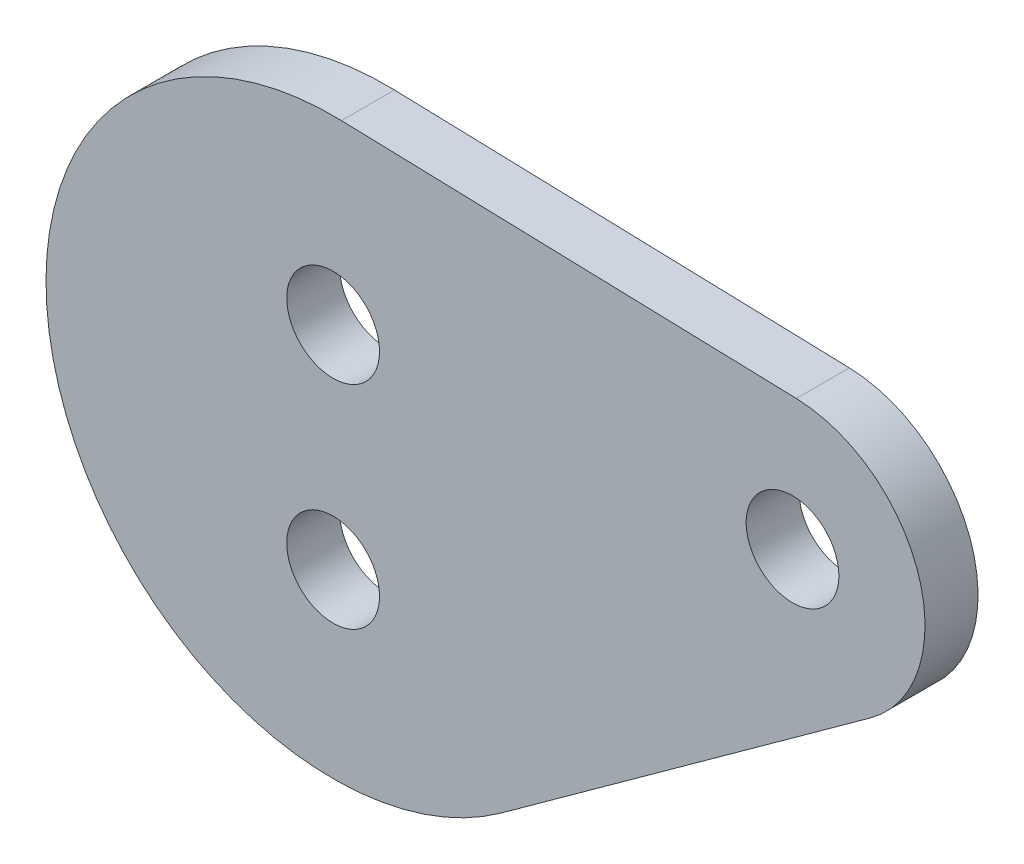
ISO-10303-21;
HEADER;
FILE_DESCRIPTION(('STEP AP214'),'2;1');
FILE_NAME('part.step','',(''),(''),'','','');
FILE_SCHEMA(('AUTOMOTIVE_DESIGN { 1 0 10303 214 1 1 1 1 }'));
ENDSEC;
DATA;
#1=APPLICATION_CONTEXT('core data for automotive mechanical design processes');
#2=APPLICATION_PROTOCOL_DEFINITION('international standard','automotive_design',2000,#1);
#3=PRODUCT_CONTEXT('',#1,'mechanical');
#4=PRODUCT('Part','Part','',(#3));
#5=PRODUCT_RELATED_PRODUCT_CATEGORY('part','',(#4));
#6=PRODUCT_DEFINITION_FORMATION('','',#4);
#7=PRODUCT_DEFINITION_CONTEXT('part definition',#1,'design');
#8=PRODUCT_DEFINITION('design','',#6,#7);
#9=PRODUCT_DEFINITION_SHAPE('','',#8);
#10=(LENGTH_UNIT() NAMED_UNIT(*) SI_UNIT(.MILLI.,.METRE.));
#11=(NAMED_UNIT(*) PLANE_ANGLE_UNIT() SI_UNIT($,.RADIAN.));
#12=(NAMED_UNIT(*) SI_UNIT($,.STERADIAN.) SOLID_ANGLE_UNIT());
#13=UNCERTAINTY_MEASURE_WITH_UNIT(LENGTH_MEASURE(1.E-05),#10,'distance_accuracy_value','');
#14=(GEOMETRIC_REPRESENTATION_CONTEXT(3) GLOBAL_UNCERTAINTY_ASSIGNED_CONTEXT((#13)) GLOBAL_UNIT_ASSIGNED_CONTEXT((#10,
#11,#12)) REPRESENTATION_CONTEXT('',''));
#15=CARTESIAN_POINT('',(0.,0.,0.));
#16=DIRECTION('',(0.,0.,1.));
#17=DIRECTION('',(1.,0.,0.));
#18=AXIS2_PLACEMENT_3D('',#15,#16,#17);
#19=CARTESIAN_POINT('',(0.,0.,6.));
#20=DIRECTION('',(0.,0.,1.));
#21=DIRECTION('',(1.,0.,0.));
#22=AXIS2_PLACEMENT_3D('',#19,#20,#21);
#23=PLANE('',#22);
#24=CARTESIAN_POINT('',(0.,-12.,6.));
#25=DIRECTION('',(0.,0.,1.));
#26=DIRECTION('',(-1.,0.,0.));
#27=AXIS2_PLACEMENT_3D('',#24,#25,#26);
#28=CIRCLE('',#27,5.25);
#29=CARTESIAN_POINT('',(-5.25,-12.,6.));
#30=VERTEX_POINT('',#29);
#31=EDGE_CURVE('E121',#30,#30,#28,.T.);
#32=ORIENTED_EDGE('',*,*,#31,.F.);
#33=EDGE_LOOP('',(#32));
#34=FACE_BOUND('',#33,.T.);
#35=CARTESIAN_POINT('',(0.,0.,6.));
#36=DIRECTION('',(0.,0.,1.));
#37=DIRECTION('',(1.,0.,0.));
#38=AXIS2_PLACEMENT_3D('',#35,#36,#37);
#39=CIRCLE('',#38,32.5);
#40=CARTESIAN_POINT('',(0.941698734756451,32.4863541120415,6.));
#41=VERTEX_POINT('',#40);
#42=CARTESIAN_POINT('',(19.0414093733517,-26.3377054633929,6.));
#43=VERTEX_POINT('',#42);
#44=EDGE_CURVE('E91',#41,#43,#39,.T.);
#45=ORIENTED_EDGE('',*,*,#44,.T.);
#46=DIRECTION('',(0.810390937335166,0.585889519180051,0.));
#47=VECTOR('',#46,1.);
#48=CARTESIAN_POINT('',(60.7883427877008,3.84413593997251,6.));
#49=LINE('',#48,#47);
#50=CARTESIAN_POINT('',(60.7883427877008,3.84413593997251,6.));
#51=VERTEX_POINT('',#50);
#52=EDGE_CURVE('E86',#43,#51,#49,.T.);
#53=ORIENTED_EDGE('',*,*,#52,.T.);
#54=CARTESIAN_POINT('',(52.,16.,6.));
#55=DIRECTION('',(0.,0.,1.));
#56=DIRECTION('',(1.,0.,0.));
#57=AXIS2_PLACEMENT_3D('',#54,#55,#56);
#58=CIRCLE('',#57,15.);
#59=CARTESIAN_POINT('',(52.4346301852722,30.9937018978653,6.));
#60=VERTEX_POINT('',#59);
#61=EDGE_CURVE('E89',#51,#60,#58,.T.);
#62=ORIENTED_EDGE('',*,*,#61,.T.);
#63=DIRECTION('',(-0.999580126524355,0.028975345684814,0.));
#64=VECTOR('',#63,1.);
#65=CARTESIAN_POINT('',(0.941698734756451,32.4863541120415,6.));
#66=LINE('',#65,#64);
#67=EDGE_CURVE('E56',#60,#41,#66,.T.);
#68=ORIENTED_EDGE('',*,*,#67,.T.);
#69=EDGE_LOOP('',(#45,#53,#62,#68));
#70=FACE_BOUND('',#69,.T.);
#71=CARTESIAN_POINT('',(0.,12.,6.));
#72=DIRECTION('',(0.,0.,1.));
#73=DIRECTION('',(1.,0.,0.));
#74=AXIS2_PLACEMENT_3D('',#71,#72,#73);
#75=CIRCLE('',#74,5.25);
#76=CARTESIAN_POINT('',(5.25,12.,6.));
#77=VERTEX_POINT('',#76);
#78=EDGE_CURVE('E106',#77,#77,#75,.T.);
#79=ORIENTED_EDGE('',*,*,#78,.F.);
#80=EDGE_LOOP('',(#79));
#81=FACE_BOUND('',#80,.T.);
#82=CARTESIAN_POINT('',(52.,16.,6.));
#83=DIRECTION('',(0.,0.,1.));
#84=DIRECTION('',(1.,0.,0.));
#85=AXIS2_PLACEMENT_3D('',#82,#83,#84);
#86=CIRCLE('',#85,5.25);
#87=CARTESIAN_POINT('',(57.25,16.,6.));
#88=VERTEX_POINT('',#87);
#89=EDGE_CURVE('E127',#88,#88,#86,.T.);
#90=ORIENTED_EDGE('',*,*,#89,.F.);
#91=EDGE_LOOP('',(#90));
#92=FACE_BOUND('',#91,.T.);
#93=ADVANCED_FACE('F39',(#34,#70,#81,#92),#23,.T.);
#94=CARTESIAN_POINT('',(0.,0.,0.));
#95=DIRECTION('',(0.,0.,1.));
#96=DIRECTION('',(1.,0.,0.));
#97=AXIS2_PLACEMENT_3D('',#94,#95,#96);
#98=PLANE('',#97);
#99=CARTESIAN_POINT('',(0.,-12.,0.));
#100=DIRECTION('',(0.,0.,1.));
#101=DIRECTION('',(-1.,0.,0.));
#102=AXIS2_PLACEMENT_3D('',#99,#100,#101);
#103=CIRCLE('',#102,5.25);
#104=CARTESIAN_POINT('',(-5.25,-12.,0.));
#105=VERTEX_POINT('',#104);
#106=EDGE_CURVE('E124',#105,#105,#103,.T.);
#107=ORIENTED_EDGE('',*,*,#106,.T.);
#108=EDGE_LOOP('',(#107));
#109=FACE_BOUND('',#108,.T.);
#110=CARTESIAN_POINT('',(0.,0.,0.));
#111=DIRECTION('',(0.,0.,1.));
#112=DIRECTION('',(1.,0.,0.));
#113=AXIS2_PLACEMENT_3D('',#110,#111,#112);
#114=CIRCLE('',#113,32.5);
#115=CARTESIAN_POINT('',(0.941698734756451,32.4863541120415,0.));
#116=VERTEX_POINT('',#115);
#117=CARTESIAN_POINT('',(19.0414093733517,-26.3377054633929,0.));
#118=VERTEX_POINT('',#117);
#119=EDGE_CURVE('E103',#116,#118,#114,.T.);
#120=ORIENTED_EDGE('',*,*,#119,.F.);
#121=DIRECTION('',(-0.999580126524355,0.028975345684814,0.));
#122=VECTOR('',#121,1.);
#123=CARTESIAN_POINT('',(0.941698734756451,32.4863541120415,0.));
#124=LINE('',#123,#122);
#125=CARTESIAN_POINT('',(52.4346301852722,30.9937018978653,0.));
#126=VERTEX_POINT('',#125);
#127=EDGE_CURVE('E79',#126,#116,#124,.T.);
#128=ORIENTED_EDGE('',*,*,#127,.F.);
#129=CARTESIAN_POINT('',(52.,16.,0.));
#130=DIRECTION('',(0.,0.,1.));
#131=DIRECTION('',(1.,0.,0.));
#132=AXIS2_PLACEMENT_3D('',#129,#130,#131);
#133=CIRCLE('',#132,15.);
#134=CARTESIAN_POINT('',(60.7883427877008,3.84413593997251,0.));
#135=VERTEX_POINT('',#134);
#136=EDGE_CURVE('E73',#135,#126,#133,.T.);
#137=ORIENTED_EDGE('',*,*,#136,.F.);
#138=DIRECTION('',(0.810390937335166,0.585889519180051,0.));
#139=VECTOR('',#138,1.);
#140=CARTESIAN_POINT('',(60.7883427877008,3.84413593997251,0.));
#141=LINE('',#140,#139);
#142=EDGE_CURVE('E95',#118,#135,#141,.T.);
#143=ORIENTED_EDGE('',*,*,#142,.F.);
#144=EDGE_LOOP('',(#120,#128,#137,#143));
#145=FACE_BOUND('',#144,.T.);
#146=CARTESIAN_POINT('',(0.,12.,0.));
#147=DIRECTION('',(0.,0.,1.));
#148=DIRECTION('',(1.,0.,0.));
#149=AXIS2_PLACEMENT_3D('',#146,#147,#148);
#150=CIRCLE('',#149,5.25);
#151=CARTESIAN_POINT('',(5.25,12.,0.));
#152=VERTEX_POINT('',#151);
#153=EDGE_CURVE('E118',#152,#152,#150,.T.);
#154=ORIENTED_EDGE('',*,*,#153,.T.);
#155=EDGE_LOOP('',(#154));
#156=FACE_BOUND('',#155,.T.);
#157=CARTESIAN_POINT('',(52.,16.,0.));
#158=DIRECTION('',(0.,0.,1.));
#159=DIRECTION('',(1.,0.,0.));
#160=AXIS2_PLACEMENT_3D('',#157,#158,#159);
#161=CIRCLE('',#160,5.25);
#162=CARTESIAN_POINT('',(57.25,16.,0.));
#163=VERTEX_POINT('',#162);
#164=EDGE_CURVE('E130',#163,#163,#161,.T.);
#165=ORIENTED_EDGE('',*,*,#164,.T.);
#166=EDGE_LOOP('',(#165));
#167=FACE_BOUND('',#166,.T.);
#168=ADVANCED_FACE('F114',(#109,#145,#156,#167),#98,.F.);
#169=CARTESIAN_POINT('',(0.,0.,6.));
#170=DIRECTION('',(0.,0.,-1.));
#171=DIRECTION('',(-1.,0.,0.));
#172=AXIS2_PLACEMENT_3D('',#169,#170,#171);
#173=CYLINDRICAL_SURFACE('',#172,32.5);
#174=ORIENTED_EDGE('',*,*,#119,.T.);
#175=DIRECTION('',(0.,0.,-1.));
#176=VECTOR('',#175,1.);
#177=CARTESIAN_POINT('',(19.0414093733517,-26.3377054633929,6.));
#178=LINE('',#177,#176);
#179=EDGE_CURVE('E11',#43,#118,#178,.T.);
#180=ORIENTED_EDGE('',*,*,#179,.F.);
#181=ORIENTED_EDGE('',*,*,#44,.F.);
#182=DIRECTION('',(0.,0.,-1.));
#183=VECTOR('',#182,1.);
#184=CARTESIAN_POINT('',(0.941698734756451,32.4863541120415,6.));
#185=LINE('',#184,#183);
#186=EDGE_CURVE('E99',#41,#116,#185,.T.);
#187=ORIENTED_EDGE('',*,*,#186,.T.);
#188=EDGE_LOOP('',(#174,#180,#181,#187));
#189=FACE_BOUND('',#188,.T.);
#190=ADVANCED_FACE('F41',(#189),#173,.T.);
#191=CARTESIAN_POINT('',(60.7883427877008,3.84413593997251,6.));
#192=DIRECTION('',(-0.585889519180051,0.810390937335166,0.));
#193=DIRECTION('',(-0.810390937335166,-0.585889519180051,0.));
#194=AXIS2_PLACEMENT_3D('',#191,#192,#193);
#195=PLANE('',#194);
#196=ORIENTED_EDGE('',*,*,#142,.T.);
#197=DIRECTION('',(0.,0.,-1.));
#198=VECTOR('',#197,1.);
#199=CARTESIAN_POINT('',(60.7883427877008,3.84413593997251,6.));
#200=LINE('',#199,#198);
#201=EDGE_CURVE('E48',#51,#135,#200,.T.);
#202=ORIENTED_EDGE('',*,*,#201,.F.);
#203=ORIENTED_EDGE('',*,*,#52,.F.);
#204=ORIENTED_EDGE('',*,*,#179,.T.);
#205=EDGE_LOOP('',(#196,#202,#203,#204));
#206=FACE_BOUND('',#205,.T.);
#207=ADVANCED_FACE('F94',(#206),#195,.F.);
#208=CARTESIAN_POINT('',(52.,16.,6.));
#209=DIRECTION('',(0.,0.,-1.));
#210=DIRECTION('',(-1.,0.,0.));
#211=AXIS2_PLACEMENT_3D('',#208,#209,#210);
#212=CYLINDRICAL_SURFACE('',#211,15.);
#213=ORIENTED_EDGE('',*,*,#136,.T.);
#214=DIRECTION('',(0.,0.,-1.));
#215=VECTOR('',#214,1.);
#216=CARTESIAN_POINT('',(52.4346301852722,30.9937018978653,6.));
#217=LINE('',#216,#215);
#218=EDGE_CURVE('E96',#60,#126,#217,.T.);
#219=ORIENTED_EDGE('',*,*,#218,.F.);
#220=ORIENTED_EDGE('',*,*,#61,.F.);
#221=ORIENTED_EDGE('',*,*,#201,.T.);
#222=EDGE_LOOP('',(#213,#219,#220,#221));
#223=FACE_BOUND('',#222,.T.);
#224=ADVANCED_FACE('F97',(#223),#212,.T.);
#225=CARTESIAN_POINT('',(0.941698734756451,32.4863541120415,6.));
#226=DIRECTION('',(-0.028975345684814,-0.999580126524355,0.));
#227=DIRECTION('',(0.999580126524355,-0.028975345684814,0.));
#228=AXIS2_PLACEMENT_3D('',#225,#226,#227);
#229=PLANE('',#228);
#230=ORIENTED_EDGE('',*,*,#127,.T.);
#231=ORIENTED_EDGE('',*,*,#186,.F.);
#232=ORIENTED_EDGE('',*,*,#67,.F.);
#233=ORIENTED_EDGE('',*,*,#218,.T.);
#234=EDGE_LOOP('',(#230,#231,#232,#233));
#235=FACE_BOUND('',#234,.T.);
#236=ADVANCED_FACE('F111',(#235),#229,.F.);
#237=CARTESIAN_POINT('',(0.,12.,6.));
#238=DIRECTION('',(0.,0.,-1.));
#239=DIRECTION('',(-1.,0.,0.));
#240=AXIS2_PLACEMENT_3D('',#237,#238,#239);
#241=CYLINDRICAL_SURFACE('',#240,5.25);
#242=ORIENTED_EDGE('',*,*,#78,.T.);
#243=EDGE_LOOP('',(#242));
#244=FACE_BOUND('',#243,.T.);
#245=ORIENTED_EDGE('',*,*,#153,.F.);
#246=EDGE_LOOP('',(#245));
#247=FACE_BOUND('',#246,.T.);
#248=ADVANCED_FACE('F149',(#244,#247),#241,.F.);
#249=CARTESIAN_POINT('',(0.,-12.,6.));
#250=DIRECTION('',(0.,0.,-1.));
#251=DIRECTION('',(-1.,0.,0.));
#252=AXIS2_PLACEMENT_3D('',#249,#250,#251);
#253=CYLINDRICAL_SURFACE('',#252,5.25);
#254=ORIENTED_EDGE('',*,*,#31,.T.);
#255=EDGE_LOOP('',(#254));
#256=FACE_BOUND('',#255,.T.);
#257=ORIENTED_EDGE('',*,*,#106,.F.);
#258=EDGE_LOOP('',(#257));
#259=FACE_BOUND('',#258,.T.);
#260=ADVANCED_FACE('F184',(#256,#259),#253,.F.);
#261=CARTESIAN_POINT('',(52.,16.,6.));
#262=DIRECTION('',(0.,0.,-1.));
#263=DIRECTION('',(-1.,0.,0.));
#264=AXIS2_PLACEMENT_3D('',#261,#262,#263);
#265=CYLINDRICAL_SURFACE('',#264,5.25);
#266=ORIENTED_EDGE('',*,*,#89,.T.);
#267=EDGE_LOOP('',(#266));
#268=FACE_BOUND('',#267,.T.);
#269=ORIENTED_EDGE('',*,*,#164,.F.);
#270=EDGE_LOOP('',(#269));
#271=FACE_BOUND('',#270,.T.);
#272=ADVANCED_FACE('F136',(#268,#271),#265,.F.);
#273=CLOSED_SHELL('',(#93,#168,#190,#207,#224,#236,#248,#260,#272));
#274=MANIFOLD_SOLID_BREP('B2',#273);
#275=ADVANCED_BREP_SHAPE_REPRESENTATION('',(#18,#274),#14);
#276=SHAPE_DEFINITION_REPRESENTATION(#9,#275);
ENDSEC;
END-ISO-10303-21;
